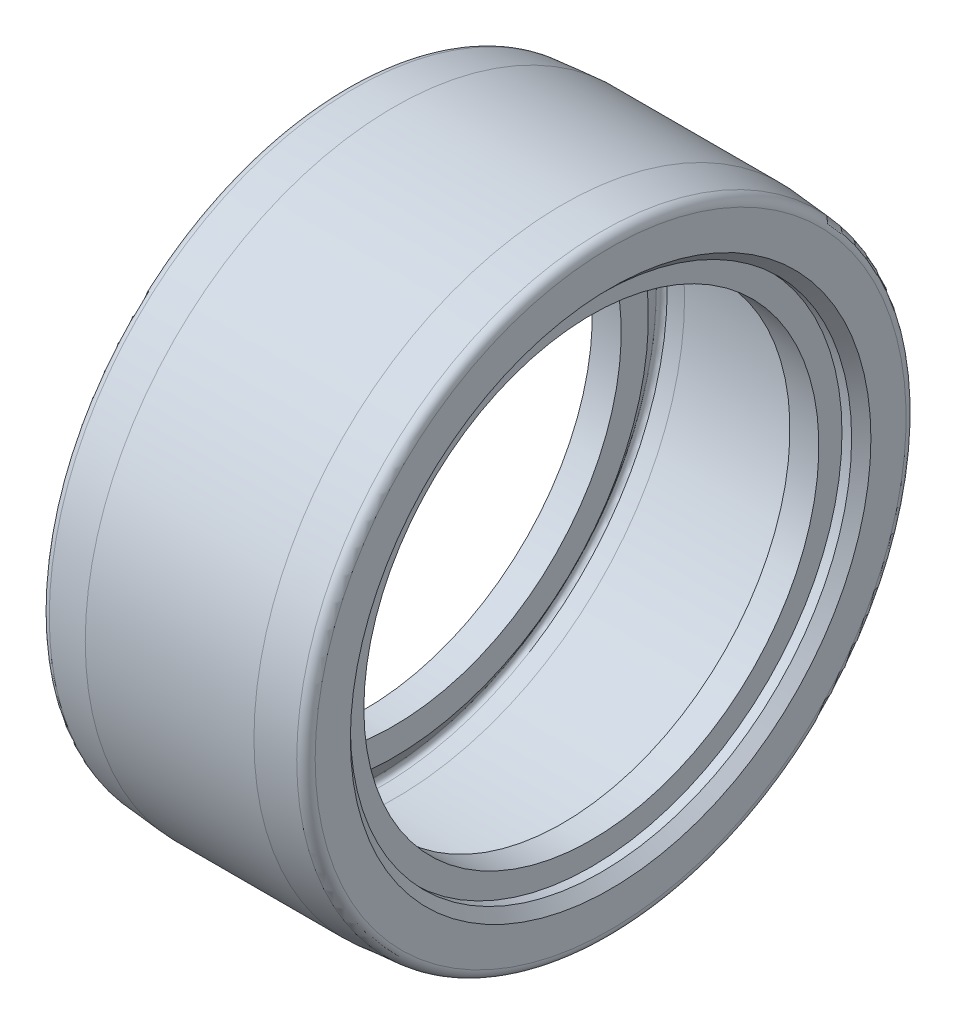
ISO-10303-21;
HEADER;
FILE_DESCRIPTION(('STEP AP214'),'2;1');
FILE_NAME('part.step','',(''),(''),'','','');
FILE_SCHEMA(('AUTOMOTIVE_DESIGN { 1 0 10303 214 1 1 1 1 }'));
ENDSEC;
DATA;
#1=APPLICATION_CONTEXT('core data for automotive mechanical design processes');
#2=APPLICATION_PROTOCOL_DEFINITION('international standard','automotive_design',2000,#1);
#3=PRODUCT_CONTEXT('',#1,'mechanical');
#4=PRODUCT('Part','Part','',(#3));
#5=PRODUCT_RELATED_PRODUCT_CATEGORY('part','',(#4));
#6=PRODUCT_DEFINITION_FORMATION('','',#4);
#7=PRODUCT_DEFINITION_CONTEXT('part definition',#1,'design');
#8=PRODUCT_DEFINITION('design','',#6,#7);
#9=PRODUCT_DEFINITION_SHAPE('','',#8);
#10=(LENGTH_UNIT() NAMED_UNIT(*) SI_UNIT(.MILLI.,.METRE.));
#11=(NAMED_UNIT(*) PLANE_ANGLE_UNIT() SI_UNIT($,.RADIAN.));
#12=(NAMED_UNIT(*) SI_UNIT($,.STERADIAN.) SOLID_ANGLE_UNIT());
#13=UNCERTAINTY_MEASURE_WITH_UNIT(LENGTH_MEASURE(1.E-05),#10,'distance_accuracy_value','');
#14=(GEOMETRIC_REPRESENTATION_CONTEXT(3) GLOBAL_UNCERTAINTY_ASSIGNED_CONTEXT((#13)) GLOBAL_UNIT_ASSIGNED_CONTEXT((#10,
#11,#12)) REPRESENTATION_CONTEXT('',''));
#15=CARTESIAN_POINT('',(0.,0.,0.));
#16=DIRECTION('',(0.,0.,1.));
#17=DIRECTION('',(1.,0.,0.));
#18=AXIS2_PLACEMENT_3D('',#15,#16,#17);
#19=CARTESIAN_POINT('',(5.00000000000004,23.6,0.));
#20=DIRECTION('',(-1.,0.,0.));
#21=DIRECTION('',(0.,0.,1.));
#22=AXIS2_PLACEMENT_3D('',#19,#20,#21);
#23=PLANE('',#22);
#24=CARTESIAN_POINT('',(5.00000000000004,0.,0.));
#25=DIRECTION('',(-1.,0.,0.));
#26=DIRECTION('',(0.,0.,1.));
#27=AXIS2_PLACEMENT_3D('',#24,#25,#26);
#28=CIRCLE('',#27,26.4221612219109);
#29=CARTESIAN_POINT('',(5.00000000000004,0.,26.4221612219109));
#30=VERTEX_POINT('',#29);
#31=EDGE_CURVE('E10',#30,#30,#28,.T.);
#32=ORIENTED_EDGE('',*,*,#31,.F.);
#33=EDGE_LOOP('',(#32));
#34=FACE_BOUND('',#33,.T.);
#35=CARTESIAN_POINT('',(5.00000000000004,0.,0.));
#36=DIRECTION('',(-1.,0.,0.));
#37=DIRECTION('',(0.,0.,1.));
#38=AXIS2_PLACEMENT_3D('',#35,#36,#37);
#39=CIRCLE('',#38,23.6);
#40=CARTESIAN_POINT('',(5.00000000000004,0.,23.6));
#41=VERTEX_POINT('',#40);
#42=EDGE_CURVE('E104',#41,#41,#39,.T.);
#43=ORIENTED_EDGE('',*,*,#42,.T.);
#44=EDGE_LOOP('',(#43));
#45=FACE_BOUND('',#44,.T.);
#46=ADVANCED_FACE('F28',(#34,#45),#23,.F.);
#47=CARTESIAN_POINT('',(5.00000000000004,0.,0.));
#48=DIRECTION('',(-1.,0.,0.));
#49=DIRECTION('',(0.,0.,1.));
#50=AXIS2_PLACEMENT_3D('',#47,#48,#49);
#51=CONICAL_SURFACE('',#50,26.4221612219109,0.961216553074876);
#52=CARTESIAN_POINT('',(3.14952210759937,0.,0.));
#53=DIRECTION('',(-1.,0.,0.));
#54=DIRECTION('',(0.,0.,1.));
#55=AXIS2_PLACEMENT_3D('',#52,#53,#54);
#56=CIRCLE('',#55,29.0721612219109);
#57=CARTESIAN_POINT('',(3.14952210759937,0.,29.0721612219109));
#58=VERTEX_POINT('',#57);
#59=EDGE_CURVE('E34',#58,#58,#56,.T.);
#60=ORIENTED_EDGE('',*,*,#59,.F.);
#61=EDGE_LOOP('',(#60));
#62=FACE_BOUND('',#61,.T.);
#63=ORIENTED_EDGE('',*,*,#31,.T.);
#64=EDGE_LOOP('',(#63));
#65=FACE_BOUND('',#64,.T.);
#66=ADVANCED_FACE('F237',(#62,#65),#51,.T.);
#67=CARTESIAN_POINT('',(3.55946644731397,0.,0.));
#68=DIRECTION('',(-1.,0.,0.));
#69=DIRECTION('',(0.,0.,1.));
#70=AXIS2_PLACEMENT_3D('',#67,#68,#69);
#71=TOROIDAL_SURFACE('',#70,29.3584227078568,0.500000000000002);
#72=CARTESIAN_POINT('',(3.51633963667996,0.,0.));
#73=DIRECTION('',(-1.,0.,0.));
#74=DIRECTION('',(0.,0.,1.));
#75=AXIS2_PLACEMENT_3D('',#72,#73,#74);
#76=CIRCLE('',#75,29.8565593138241);
#77=CARTESIAN_POINT('',(3.51633963667996,0.,29.8565593138241));
#78=VERTEX_POINT('',#77);
#79=EDGE_CURVE('E38',#78,#78,#76,.T.);
#80=ORIENTED_EDGE('',*,*,#79,.F.);
#81=EDGE_LOOP('',(#80));
#82=FACE_BOUND('',#81,.T.);
#83=ORIENTED_EDGE('',*,*,#59,.T.);
#84=EDGE_LOOP('',(#83));
#85=FACE_BOUND('',#84,.T.);
#86=ADVANCED_FACE('F232',(#82,#85),#71,.F.);
#87=CARTESIAN_POINT('',(3.51633963667996,0.,0.));
#88=DIRECTION('',(1.,0.,0.));
#89=DIRECTION('',(0.,0.,-1.));
#90=AXIS2_PLACEMENT_3D('',#87,#88,#89);
#91=CONICAL_SURFACE('',#90,29.8565593138241,0.0863609309086317);
#92=CARTESIAN_POINT('',(5.17315254537566,0.,0.));
#93=DIRECTION('',(-1.,0.,0.));
#94=DIRECTION('',(0.,0.,1.));
#95=AXIS2_PLACEMENT_3D('',#92,#93,#94);
#96=CIRCLE('',#95,30.);
#97=CARTESIAN_POINT('',(5.17315254537566,0.,30.));
#98=VERTEX_POINT('',#97);
#99=EDGE_CURVE('E42',#98,#98,#96,.T.);
#100=ORIENTED_EDGE('',*,*,#99,.F.);
#101=EDGE_LOOP('',(#100));
#102=FACE_BOUND('',#101,.T.);
#103=ORIENTED_EDGE('',*,*,#79,.T.);
#104=EDGE_LOOP('',(#103));
#105=FACE_BOUND('',#104,.T.);
#106=ADVANCED_FACE('F226',(#102,#105),#91,.F.);
#107=CARTESIAN_POINT('',(0.,0.,0.));
#108=DIRECTION('',(-1.,0.,0.));
#109=DIRECTION('',(0.,0.,1.));
#110=AXIS2_PLACEMENT_3D('',#107,#108,#109);
#111=CYLINDRICAL_SURFACE('',#110,30.);
#112=CARTESIAN_POINT('',(22.325638556484,0.,0.));
#113=DIRECTION('',(-1.,0.,0.));
#114=DIRECTION('',(0.,0.,1.));
#115=AXIS2_PLACEMENT_3D('',#112,#113,#114);
#116=CIRCLE('',#115,30.);
#117=CARTESIAN_POINT('',(22.325638556484,0.,30.));
#118=VERTEX_POINT('',#117);
#119=EDGE_CURVE('E47',#118,#118,#116,.T.);
#120=ORIENTED_EDGE('',*,*,#119,.F.);
#121=EDGE_LOOP('',(#120));
#122=FACE_BOUND('',#121,.T.);
#123=ORIENTED_EDGE('',*,*,#99,.T.);
#124=EDGE_LOOP('',(#123));
#125=FACE_BOUND('',#124,.T.);
#126=ADVANCED_FACE('F220',(#122,#125),#111,.F.);
#127=CARTESIAN_POINT('',(22.325638556484,0.,0.));
#128=DIRECTION('',(-1.,0.,0.));
#129=DIRECTION('',(0.,0.,1.));
#130=AXIS2_PLACEMENT_3D('',#127,#128,#129);
#131=CONICAL_SURFACE('',#130,30.,0.0868367027258404);
#132=CARTESIAN_POINT('',(23.9878694683771,0.,0.));
#133=DIRECTION('',(-1.,0.,0.));
#134=DIRECTION('',(0.,0.,1.));
#135=AXIS2_PLACEMENT_3D('',#132,#133,#134);
#136=CIRCLE('',#135,29.8552934400772);
#137=CARTESIAN_POINT('',(23.9878694683771,0.,29.8552934400772));
#138=VERTEX_POINT('',#137);
#139=EDGE_CURVE('E50',#138,#138,#136,.T.);
#140=ORIENTED_EDGE('',*,*,#139,.F.);
#141=EDGE_LOOP('',(#140));
#142=FACE_BOUND('',#141,.T.);
#143=ORIENTED_EDGE('',*,*,#119,.T.);
#144=EDGE_LOOP('',(#143));
#145=FACE_BOUND('',#144,.T.);
#146=ADVANCED_FACE('F214',(#142,#145),#131,.F.);
#147=CARTESIAN_POINT('',(23.9427382899971,0.,0.));
#148=DIRECTION('',(-1.,0.,0.));
#149=DIRECTION('',(0.,0.,1.));
#150=AXIS2_PLACEMENT_3D('',#147,#148,#149);
#151=TOROIDAL_SURFACE('',#150,29.3573344289749,0.500000000000016);
#152=CARTESIAN_POINT('',(24.3534404229023,0.,0.));
#153=DIRECTION('',(-1.,0.,0.));
#154=DIRECTION('',(0.,0.,1.));
#155=AXIS2_PLACEMENT_3D('',#152,#153,#154);
#156=CIRCLE('',#155,29.0721612219109);
#157=CARTESIAN_POINT('',(24.3534404229023,0.,29.0721612219109));
#158=VERTEX_POINT('',#157);
#159=EDGE_CURVE('E53',#158,#158,#156,.T.);
#160=ORIENTED_EDGE('',*,*,#159,.F.);
#161=EDGE_LOOP('',(#160));
#162=FACE_BOUND('',#161,.T.);
#163=ORIENTED_EDGE('',*,*,#139,.T.);
#164=EDGE_LOOP('',(#163));
#165=FACE_BOUND('',#164,.T.);
#166=ADVANCED_FACE('F208',(#162,#165),#151,.F.);
#167=CARTESIAN_POINT('',(24.3534404229023,0.,0.));
#168=DIRECTION('',(1.,0.,0.));
#169=DIRECTION('',(0.,0.,-1.));
#170=AXIS2_PLACEMENT_3D('',#167,#168,#169);
#171=CONICAL_SURFACE('',#170,29.0721612219109,0.960465451258843);
#172=CARTESIAN_POINT('',(22.5,0.,0.));
#173=DIRECTION('',(-1.,0.,0.));
#174=DIRECTION('',(0.,0.,1.));
#175=AXIS2_PLACEMENT_3D('',#172,#173,#174);
#176=CIRCLE('',#175,26.4221612219109);
#177=CARTESIAN_POINT('',(22.5,0.,26.4221612219109));
#178=VERTEX_POINT('',#177);
#179=EDGE_CURVE('E56',#178,#178,#176,.T.);
#180=ORIENTED_EDGE('',*,*,#179,.F.);
#181=EDGE_LOOP('',(#180));
#182=FACE_BOUND('',#181,.T.);
#183=ORIENTED_EDGE('',*,*,#159,.T.);
#184=EDGE_LOOP('',(#183));
#185=FACE_BOUND('',#184,.T.);
#186=ADVANCED_FACE('F202',(#182,#185),#171,.T.);
#187=CARTESIAN_POINT('',(22.5,23.6,0.));
#188=DIRECTION('',(1.,0.,0.));
#189=DIRECTION('',(0.,0.,-1.));
#190=AXIS2_PLACEMENT_3D('',#187,#188,#189);
#191=PLANE('',#190);
#192=CARTESIAN_POINT('',(22.5,0.,0.));
#193=DIRECTION('',(-1.,0.,0.));
#194=DIRECTION('',(0.,0.,1.));
#195=AXIS2_PLACEMENT_3D('',#192,#193,#194);
#196=CIRCLE('',#195,23.6);
#197=CARTESIAN_POINT('',(22.5,0.,23.6));
#198=VERTEX_POINT('',#197);
#199=EDGE_CURVE('E59',#198,#198,#196,.T.);
#200=ORIENTED_EDGE('',*,*,#199,.F.);
#201=EDGE_LOOP('',(#200));
#202=FACE_BOUND('',#201,.T.);
#203=ORIENTED_EDGE('',*,*,#179,.T.);
#204=EDGE_LOOP('',(#203));
#205=FACE_BOUND('',#204,.T.);
#206=ADVANCED_FACE('F196',(#202,#205),#191,.F.);
#207=CARTESIAN_POINT('',(0.,0.,0.));
#208=DIRECTION('',(-1.,0.,0.));
#209=DIRECTION('',(0.,0.,1.));
#210=AXIS2_PLACEMENT_3D('',#207,#208,#209);
#211=CYLINDRICAL_SURFACE('',#210,23.6);
#212=CARTESIAN_POINT('',(25.5,0.,0.));
#213=DIRECTION('',(-1.,0.,0.));
#214=DIRECTION('',(0.,0.,1.));
#215=AXIS2_PLACEMENT_3D('',#212,#213,#214);
#216=CIRCLE('',#215,23.6);
#217=CARTESIAN_POINT('',(25.5,0.,23.6));
#218=VERTEX_POINT('',#217);
#219=EDGE_CURVE('E62',#218,#218,#216,.T.);
#220=ORIENTED_EDGE('',*,*,#219,.F.);
#221=EDGE_LOOP('',(#220));
#222=FACE_BOUND('',#221,.T.);
#223=ORIENTED_EDGE('',*,*,#199,.T.);
#224=EDGE_LOOP('',(#223));
#225=FACE_BOUND('',#224,.T.);
#226=ADVANCED_FACE('F190',(#222,#225),#211,.F.);
#227=CARTESIAN_POINT('',(25.5,23.6,0.));
#228=DIRECTION('',(-1.,0.,0.));
#229=DIRECTION('',(0.,0.,1.));
#230=AXIS2_PLACEMENT_3D('',#227,#228,#229);
#231=PLANE('',#230);
#232=CARTESIAN_POINT('',(25.5,0.,0.));
#233=DIRECTION('',(-1.,0.,0.));
#234=DIRECTION('',(0.,0.,1.));
#235=AXIS2_PLACEMENT_3D('',#232,#233,#234);
#236=CIRCLE('',#235,26.);
#237=CARTESIAN_POINT('',(25.5,0.,26.));
#238=VERTEX_POINT('',#237);
#239=EDGE_CURVE('E65',#238,#238,#236,.T.);
#240=ORIENTED_EDGE('',*,*,#239,.F.);
#241=EDGE_LOOP('',(#240));
#242=FACE_BOUND('',#241,.T.);
#243=ORIENTED_EDGE('',*,*,#219,.T.);
#244=EDGE_LOOP('',(#243));
#245=FACE_BOUND('',#244,.T.);
#246=ADVANCED_FACE('F184',(#242,#245),#231,.F.);
#247=CARTESIAN_POINT('',(0.,0.,0.));
#248=DIRECTION('',(-1.,0.,0.));
#249=DIRECTION('',(0.,0.,1.));
#250=AXIS2_PLACEMENT_3D('',#247,#248,#249);
#251=CYLINDRICAL_SURFACE('',#250,26.);
#252=CARTESIAN_POINT('',(26.5,0.,0.));
#253=DIRECTION('',(-1.,0.,0.));
#254=DIRECTION('',(0.,0.,1.));
#255=AXIS2_PLACEMENT_3D('',#252,#253,#254);
#256=CIRCLE('',#255,26.);
#257=CARTESIAN_POINT('',(26.5,0.,26.));
#258=VERTEX_POINT('',#257);
#259=EDGE_CURVE('E68',#258,#258,#256,.T.);
#260=ORIENTED_EDGE('',*,*,#259,.F.);
#261=EDGE_LOOP('',(#260));
#262=FACE_BOUND('',#261,.T.);
#263=ORIENTED_EDGE('',*,*,#239,.T.);
#264=EDGE_LOOP('',(#263));
#265=FACE_BOUND('',#264,.T.);
#266=ADVANCED_FACE('F178',(#262,#265),#251,.F.);
#267=CARTESIAN_POINT('',(26.5,0.,0.));
#268=DIRECTION('',(1.,0.,0.));
#269=DIRECTION('',(0.,0.,-1.));
#270=AXIS2_PLACEMENT_3D('',#267,#268,#269);
#271=CONICAL_SURFACE('',#270,26.,0.785398163397448);
#272=CARTESIAN_POINT('',(27.5,0.,0.));
#273=DIRECTION('',(-1.,0.,0.));
#274=DIRECTION('',(0.,0.,1.));
#275=AXIS2_PLACEMENT_3D('',#272,#273,#274);
#276=CIRCLE('',#275,27.);
#277=CARTESIAN_POINT('',(27.5,0.,27.));
#278=VERTEX_POINT('',#277);
#279=EDGE_CURVE('E71',#278,#278,#276,.T.);
#280=ORIENTED_EDGE('',*,*,#279,.F.);
#281=EDGE_LOOP('',(#280));
#282=FACE_BOUND('',#281,.T.);
#283=ORIENTED_EDGE('',*,*,#259,.T.);
#284=EDGE_LOOP('',(#283));
#285=FACE_BOUND('',#284,.T.);
#286=ADVANCED_FACE('F172',(#282,#285),#271,.F.);
#287=CARTESIAN_POINT('',(27.5,30.65,0.));
#288=DIRECTION('',(-1.,0.,0.));
#289=DIRECTION('',(0.,0.,1.));
#290=AXIS2_PLACEMENT_3D('',#287,#288,#289);
#291=PLANE('',#290);
#292=CARTESIAN_POINT('',(27.5,0.,0.));
#293=DIRECTION('',(-1.,0.,0.));
#294=DIRECTION('',(0.,0.,1.));
#295=AXIS2_PLACEMENT_3D('',#292,#293,#294);
#296=CIRCLE('',#295,30.65);
#297=CARTESIAN_POINT('',(27.5,0.,30.65));
#298=VERTEX_POINT('',#297);
#299=EDGE_CURVE('E74',#298,#298,#296,.T.);
#300=ORIENTED_EDGE('',*,*,#299,.F.);
#301=EDGE_LOOP('',(#300));
#302=FACE_BOUND('',#301,.T.);
#303=ORIENTED_EDGE('',*,*,#279,.T.);
#304=EDGE_LOOP('',(#303));
#305=FACE_BOUND('',#304,.T.);
#306=ADVANCED_FACE('F166',(#302,#305),#291,.F.);
#307=CARTESIAN_POINT('',(26.50000722117,0.,0.));
#308=DIRECTION('',(-1.,0.,0.));
#309=DIRECTION('',(0.,0.,1.));
#310=AXIS2_PLACEMENT_3D('',#307,#308,#309);
#311=TOROIDAL_SURFACE('',#310,30.6538003010308,1.);
#312=CARTESIAN_POINT('',(26.5871057847269,0.,0.));
#313=DIRECTION('',(-1.,0.,0.));
#314=DIRECTION('',(0.,0.,1.));
#315=AXIS2_PLACEMENT_3D('',#312,#313,#314);
#316=CIRCLE('',#315,31.65);
#317=CARTESIAN_POINT('',(26.5871057847269,0.,31.65));
#318=VERTEX_POINT('',#317);
#319=EDGE_CURVE('E77',#318,#318,#316,.T.);
#320=ORIENTED_EDGE('',*,*,#319,.F.);
#321=EDGE_LOOP('',(#320));
#322=FACE_BOUND('',#321,.T.);
#323=ORIENTED_EDGE('',*,*,#299,.T.);
#324=EDGE_LOOP('',(#323));
#325=FACE_BOUND('',#324,.T.);
#326=ADVANCED_FACE('F160',(#322,#325),#311,.T.);
#327=CARTESIAN_POINT('',(26.5871057847269,0.,0.));
#328=DIRECTION('',(-1.,0.,0.));
#329=DIRECTION('',(0.,0.,1.));
#330=AXIS2_PLACEMENT_3D('',#327,#328,#329);
#331=CONICAL_SURFACE('',#330,31.65,0.0854257156606527);
#332=CARTESIAN_POINT('',(22.4999500419793,0.,0.));
#333=DIRECTION('',(-1.,0.,0.));
#334=DIRECTION('',(0.,0.,1.));
#335=AXIS2_PLACEMENT_3D('',#332,#333,#334);
#336=CIRCLE('',#335,32.);
#337=CARTESIAN_POINT('',(22.4999500419793,0.,32.));
#338=VERTEX_POINT('',#337);
#339=EDGE_CURVE('E80',#338,#338,#336,.T.);
#340=ORIENTED_EDGE('',*,*,#339,.F.);
#341=EDGE_LOOP('',(#340));
#342=FACE_BOUND('',#341,.T.);
#343=ORIENTED_EDGE('',*,*,#319,.T.);
#344=EDGE_LOOP('',(#343));
#345=FACE_BOUND('',#344,.T.);
#346=ADVANCED_FACE('F154',(#342,#345),#331,.T.);
#347=CARTESIAN_POINT('',(0.,0.,0.));
#348=DIRECTION('',(-1.,0.,0.));
#349=DIRECTION('',(0.,0.,1.));
#350=AXIS2_PLACEMENT_3D('',#347,#348,#349);
#351=CYLINDRICAL_SURFACE('',#350,32.);
#352=CARTESIAN_POINT('',(5.00000000000004,0.,0.));
#353=DIRECTION('',(-1.,0.,0.));
#354=DIRECTION('',(0.,0.,1.));
#355=AXIS2_PLACEMENT_3D('',#352,#353,#354);
#356=CIRCLE('',#355,32.);
#357=CARTESIAN_POINT('',(5.00000000000004,0.,32.));
#358=VERTEX_POINT('',#357);
#359=EDGE_CURVE('E83',#358,#358,#356,.T.);
#360=ORIENTED_EDGE('',*,*,#359,.F.);
#361=EDGE_LOOP('',(#360));
#362=FACE_BOUND('',#361,.T.);
#363=ORIENTED_EDGE('',*,*,#339,.T.);
#364=EDGE_LOOP('',(#363));
#365=FACE_BOUND('',#364,.T.);
#366=ADVANCED_FACE('F148',(#362,#365),#351,.T.);
#367=CARTESIAN_POINT('',(5.00000000000004,0.,0.));
#368=DIRECTION('',(1.,0.,0.));
#369=DIRECTION('',(0.,0.,-1.));
#370=AXIS2_PLACEMENT_3D('',#367,#368,#369);
#371=CONICAL_SURFACE('',#370,32.,0.0863609309086274);
#372=CARTESIAN_POINT('',(0.913700729771413,0.,0.));
#373=DIRECTION('',(-1.,0.,0.));
#374=DIRECTION('',(0.,0.,1.));
#375=AXIS2_PLACEMENT_3D('',#372,#373,#374);
#376=CIRCLE('',#375,31.6462234400966);
#377=CARTESIAN_POINT('',(0.913700729771413,0.,31.6462234400966));
#378=VERTEX_POINT('',#377);
#379=EDGE_CURVE('E86',#378,#378,#376,.T.);
#380=ORIENTED_EDGE('',*,*,#379,.F.);
#381=EDGE_LOOP('',(#380));
#382=FACE_BOUND('',#381,.T.);
#383=ORIENTED_EDGE('',*,*,#359,.T.);
#384=EDGE_LOOP('',(#383));
#385=FACE_BOUND('',#384,.T.);
#386=ADVANCED_FACE('F142',(#382,#385),#371,.T.);
#387=CARTESIAN_POINT('',(0.999950041979228,0.,0.));
#388=DIRECTION('',(-1.,0.,0.));
#389=DIRECTION('',(0.,0.,1.));
#390=AXIS2_PLACEMENT_3D('',#387,#388,#389);
#391=TOROIDAL_SURFACE('',#390,30.65,0.999950041979229);
#392=CARTESIAN_POINT('',(0.,0.,0.));
#393=DIRECTION('',(-1.,0.,0.));
#394=DIRECTION('',(0.,0.,1.));
#395=AXIS2_PLACEMENT_3D('',#392,#393,#394);
#396=CIRCLE('',#395,30.65);
#397=CARTESIAN_POINT('',(0.,0.,30.65));
#398=VERTEX_POINT('',#397);
#399=EDGE_CURVE('E89',#398,#398,#396,.T.);
#400=ORIENTED_EDGE('',*,*,#399,.F.);
#401=EDGE_LOOP('',(#400));
#402=FACE_BOUND('',#401,.T.);
#403=ORIENTED_EDGE('',*,*,#379,.T.);
#404=EDGE_LOOP('',(#403));
#405=FACE_BOUND('',#404,.T.);
#406=ADVANCED_FACE('F136',(#402,#405),#391,.T.);
#407=CARTESIAN_POINT('',(0.,30.65,0.));
#408=DIRECTION('',(1.,0.,0.));
#409=DIRECTION('',(0.,0.,-1.));
#410=AXIS2_PLACEMENT_3D('',#407,#408,#409);
#411=PLANE('',#410);
#412=CARTESIAN_POINT('',(0.,0.,0.));
#413=DIRECTION('',(-1.,0.,0.));
#414=DIRECTION('',(0.,0.,1.));
#415=AXIS2_PLACEMENT_3D('',#412,#413,#414);
#416=CIRCLE('',#415,27.);
#417=CARTESIAN_POINT('',(0.,0.,27.));
#418=VERTEX_POINT('',#417);
#419=EDGE_CURVE('E92',#418,#418,#416,.T.);
#420=ORIENTED_EDGE('',*,*,#419,.F.);
#421=EDGE_LOOP('',(#420));
#422=FACE_BOUND('',#421,.T.);
#423=ORIENTED_EDGE('',*,*,#399,.T.);
#424=EDGE_LOOP('',(#423));
#425=FACE_BOUND('',#424,.T.);
#426=ADVANCED_FACE('F130',(#422,#425),#411,.F.);
#427=CARTESIAN_POINT('',(0.,0.,0.));
#428=DIRECTION('',(-1.,0.,0.));
#429=DIRECTION('',(0.,0.,1.));
#430=AXIS2_PLACEMENT_3D('',#427,#428,#429);
#431=CONICAL_SURFACE('',#430,27.,0.785398163397428);
#432=CARTESIAN_POINT('',(1.00000000000005,0.,0.));
#433=DIRECTION('',(-1.,0.,0.));
#434=DIRECTION('',(0.,0.,1.));
#435=AXIS2_PLACEMENT_3D('',#432,#433,#434);
#436=CIRCLE('',#435,26.);
#437=CARTESIAN_POINT('',(1.00000000000005,0.,26.));
#438=VERTEX_POINT('',#437);
#439=EDGE_CURVE('E95',#438,#438,#436,.T.);
#440=ORIENTED_EDGE('',*,*,#439,.F.);
#441=EDGE_LOOP('',(#440));
#442=FACE_BOUND('',#441,.T.);
#443=ORIENTED_EDGE('',*,*,#419,.T.);
#444=EDGE_LOOP('',(#443));
#445=FACE_BOUND('',#444,.T.);
#446=ADVANCED_FACE('F124',(#442,#445),#431,.F.);
#447=CARTESIAN_POINT('',(0.,0.,0.));
#448=DIRECTION('',(-1.,0.,0.));
#449=DIRECTION('',(0.,0.,1.));
#450=AXIS2_PLACEMENT_3D('',#447,#448,#449);
#451=CYLINDRICAL_SURFACE('',#450,26.);
#452=CARTESIAN_POINT('',(2.00000000000005,0.,0.));
#453=DIRECTION('',(-1.,0.,0.));
#454=DIRECTION('',(0.,0.,1.));
#455=AXIS2_PLACEMENT_3D('',#452,#453,#454);
#456=CIRCLE('',#455,26.);
#457=CARTESIAN_POINT('',(2.00000000000005,0.,26.));
#458=VERTEX_POINT('',#457);
#459=EDGE_CURVE('E98',#458,#458,#456,.T.);
#460=ORIENTED_EDGE('',*,*,#459,.F.);
#461=EDGE_LOOP('',(#460));
#462=FACE_BOUND('',#461,.T.);
#463=ORIENTED_EDGE('',*,*,#439,.T.);
#464=EDGE_LOOP('',(#463));
#465=FACE_BOUND('',#464,.T.);
#466=ADVANCED_FACE('F118',(#462,#465),#451,.F.);
#467=CARTESIAN_POINT('',(2.00000000000005,23.6,0.));
#468=DIRECTION('',(1.,0.,0.));
#469=DIRECTION('',(0.,0.,-1.));
#470=AXIS2_PLACEMENT_3D('',#467,#468,#469);
#471=PLANE('',#470);
#472=CARTESIAN_POINT('',(2.00000000000005,0.,0.));
#473=DIRECTION('',(-1.,0.,0.));
#474=DIRECTION('',(0.,0.,1.));
#475=AXIS2_PLACEMENT_3D('',#472,#473,#474);
#476=CIRCLE('',#475,23.6);
#477=CARTESIAN_POINT('',(2.00000000000005,0.,23.6));
#478=VERTEX_POINT('',#477);
#479=EDGE_CURVE('E101',#478,#478,#476,.T.);
#480=ORIENTED_EDGE('',*,*,#479,.F.);
#481=EDGE_LOOP('',(#480));
#482=FACE_BOUND('',#481,.T.);
#483=ORIENTED_EDGE('',*,*,#459,.T.);
#484=EDGE_LOOP('',(#483));
#485=FACE_BOUND('',#484,.T.);
#486=ADVANCED_FACE('F112',(#482,#485),#471,.F.);
#487=CARTESIAN_POINT('',(0.,0.,0.));
#488=DIRECTION('',(-1.,0.,0.));
#489=DIRECTION('',(0.,0.,1.));
#490=AXIS2_PLACEMENT_3D('',#487,#488,#489);
#491=CYLINDRICAL_SURFACE('',#490,23.6);
#492=ORIENTED_EDGE('',*,*,#42,.F.);
#493=EDGE_LOOP('',(#492));
#494=FACE_BOUND('',#493,.T.);
#495=ORIENTED_EDGE('',*,*,#479,.T.);
#496=EDGE_LOOP('',(#495));
#497=FACE_BOUND('',#496,.T.);
#498=ADVANCED_FACE('F109',(#494,#497),#491,.F.);
#499=CLOSED_SHELL('',(#46,#66,#86,#106,#126,#146,#166,#186,#206,#226,#246,#266,#286,#306,#326,
#346,#366,#386,#406,#426,#446,#466,#486,#498));
#500=MANIFOLD_SOLID_BREP('B2',#499);
#501=ADVANCED_BREP_SHAPE_REPRESENTATION('',(#18,#500),#14);
#502=SHAPE_DEFINITION_REPRESENTATION(#9,#501);
ENDSEC;
END-ISO-10303-21;
